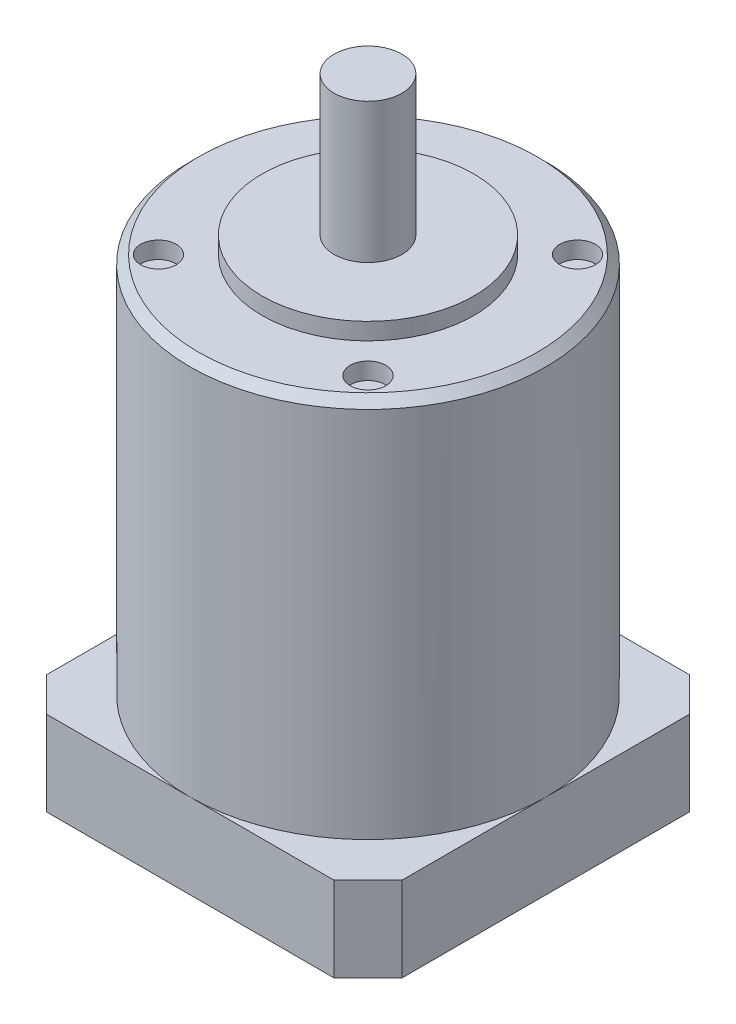
ISO-10303-21;
HEADER;
FILE_DESCRIPTION(('STEP AP214'),'2;1');
FILE_NAME('part.step','',(''),(''),'','','');
FILE_SCHEMA(('AUTOMOTIVE_DESIGN { 1 0 10303 214 1 1 1 1 }'));
ENDSEC;
DATA;
#1=APPLICATION_CONTEXT('core data for automotive mechanical design processes');
#2=APPLICATION_PROTOCOL_DEFINITION('international standard','automotive_design',2000,#1);
#3=PRODUCT_CONTEXT('',#1,'mechanical');
#4=PRODUCT('Part','Part','',(#3));
#5=PRODUCT_RELATED_PRODUCT_CATEGORY('part','',(#4));
#6=PRODUCT_DEFINITION_FORMATION('','',#4);
#7=PRODUCT_DEFINITION_CONTEXT('part definition',#1,'design');
#8=PRODUCT_DEFINITION('design','',#6,#7);
#9=PRODUCT_DEFINITION_SHAPE('','',#8);
#10=(LENGTH_UNIT() NAMED_UNIT(*) SI_UNIT(.MILLI.,.METRE.));
#11=(NAMED_UNIT(*) PLANE_ANGLE_UNIT() SI_UNIT($,.RADIAN.));
#12=(NAMED_UNIT(*) SI_UNIT($,.STERADIAN.) SOLID_ANGLE_UNIT());
#13=UNCERTAINTY_MEASURE_WITH_UNIT(LENGTH_MEASURE(1.E-05),#10,'distance_accuracy_value','');
#14=(GEOMETRIC_REPRESENTATION_CONTEXT(3) GLOBAL_UNCERTAINTY_ASSIGNED_CONTEXT((#13)) GLOBAL_UNIT_ASSIGNED_CONTEXT((#10,
#11,#12)) REPRESENTATION_CONTEXT('',''));
#15=CARTESIAN_POINT('',(0.,0.,0.));
#16=DIRECTION('',(0.,0.,1.));
#17=DIRECTION('',(1.,0.,0.));
#18=AXIS2_PLACEMENT_3D('',#15,#16,#17);
#19=CARTESIAN_POINT('',(0.,10.,0.));
#20=DIRECTION('',(0.,-1.,0.));
#21=DIRECTION('',(0.,0.,-1.));
#22=AXIS2_PLACEMENT_3D('',#19,#20,#21);
#23=PLANE('',#22);
#24=DIRECTION('',(1.,0.,0.));
#25=VECTOR('',#24,1.);
#26=CARTESIAN_POINT('',(-21.,10.,21.));
#27=LINE('',#26,#25);
#28=CARTESIAN_POINT('',(0.,10.,21.));
#29=VERTEX_POINT('',#28);
#30=CARTESIAN_POINT('',(17.,10.,21.));
#31=VERTEX_POINT('',#30);
#32=EDGE_CURVE('E120',#29,#31,#27,.T.);
#33=ORIENTED_EDGE('',*,*,#32,.T.);
#34=DIRECTION('',(-0.70710678118655,0.,0.707106781186545));
#35=VECTOR('',#34,1.);
#36=CARTESIAN_POINT('',(21.,10.,17.));
#37=LINE('',#36,#35);
#38=CARTESIAN_POINT('',(21.,10.,17.));
#39=VERTEX_POINT('',#38);
#40=EDGE_CURVE('E193',#31,#39,#37,.F.);
#41=ORIENTED_EDGE('',*,*,#40,.T.);
#42=DIRECTION('',(0.,0.,-1.));
#43=VECTOR('',#42,1.);
#44=CARTESIAN_POINT('',(21.,10.,21.));
#45=LINE('',#44,#43);
#46=CARTESIAN_POINT('',(21.,10.,0.));
#47=VERTEX_POINT('',#46);
#48=EDGE_CURVE('E130',#39,#47,#45,.T.);
#49=ORIENTED_EDGE('',*,*,#48,.T.);
#50=CARTESIAN_POINT('',(0.,10.,0.));
#51=DIRECTION('',(0.,1.,0.));
#52=DIRECTION('',(0.,0.,1.));
#53=AXIS2_PLACEMENT_3D('',#50,#51,#52);
#54=CIRCLE('',#53,21.);
#55=EDGE_CURVE('E128',#29,#47,#54,.T.);
#56=ORIENTED_EDGE('',*,*,#55,.F.);
#57=EDGE_LOOP('',(#33,#41,#49,#56));
#58=FACE_BOUND('',#57,.T.);
#59=ADVANCED_FACE('F35',(#58),#23,.F.);
#60=CARTESIAN_POINT('',(21.,10.,-17.));
#61=VERTEX_POINT('',#60);
#62=EDGE_CURVE('E147',#47,#61,#45,.T.);
#63=ORIENTED_EDGE('',*,*,#62,.T.);
#64=DIRECTION('',(0.707106781186546,0.,0.707106781186549));
#65=VECTOR('',#64,1.);
#66=CARTESIAN_POINT('',(17.,10.,-21.));
#67=LINE('',#66,#65);
#68=CARTESIAN_POINT('',(17.,10.,-21.));
#69=VERTEX_POINT('',#68);
#70=EDGE_CURVE('E180',#61,#69,#67,.F.);
#71=ORIENTED_EDGE('',*,*,#70,.T.);
#72=DIRECTION('',(-1.,0.,0.));
#73=VECTOR('',#72,1.);
#74=CARTESIAN_POINT('',(-21.,10.,-21.));
#75=LINE('',#74,#73);
#76=CARTESIAN_POINT('',(0.,10.,-21.));
#77=VERTEX_POINT('',#76);
#78=EDGE_CURVE('E148',#69,#77,#75,.T.);
#79=ORIENTED_EDGE('',*,*,#78,.T.);
#80=EDGE_CURVE('E137',#47,#77,#54,.T.);
#81=ORIENTED_EDGE('',*,*,#80,.F.);
#82=EDGE_LOOP('',(#63,#71,#79,#81));
#83=FACE_BOUND('',#82,.T.);
#84=ADVANCED_FACE('F221',(#83),#23,.F.);
#85=CARTESIAN_POINT('',(-17.,10.,-21.));
#86=VERTEX_POINT('',#85);
#87=EDGE_CURVE('E146',#77,#86,#75,.T.);
#88=ORIENTED_EDGE('',*,*,#87,.T.);
#89=DIRECTION('',(0.707106781186549,0.,-0.707106781186546));
#90=VECTOR('',#89,1.);
#91=CARTESIAN_POINT('',(-21.,10.,-17.));
#92=LINE('',#91,#90);
#93=CARTESIAN_POINT('',(-21.,10.,-17.));
#94=VERTEX_POINT('',#93);
#95=EDGE_CURVE('E187',#86,#94,#92,.F.);
#96=ORIENTED_EDGE('',*,*,#95,.T.);
#97=DIRECTION('',(0.,0.,1.));
#98=VECTOR('',#97,1.);
#99=CARTESIAN_POINT('',(-21.,10.,21.));
#100=LINE('',#99,#98);
#101=CARTESIAN_POINT('',(-21.,10.,0.));
#102=VERTEX_POINT('',#101);
#103=EDGE_CURVE('E126',#94,#102,#100,.T.);
#104=ORIENTED_EDGE('',*,*,#103,.T.);
#105=EDGE_CURVE('E141',#77,#102,#54,.T.);
#106=ORIENTED_EDGE('',*,*,#105,.F.);
#107=EDGE_LOOP('',(#88,#96,#104,#106));
#108=FACE_BOUND('',#107,.T.);
#109=ADVANCED_FACE('F226',(#108),#23,.F.);
#110=CARTESIAN_POINT('',(21.,10.,21.));
#111=DIRECTION('',(-1.,0.,0.));
#112=DIRECTION('',(0.,0.,1.));
#113=AXIS2_PLACEMENT_3D('',#110,#111,#112);
#114=PLANE('',#113);
#115=DIRECTION('',(0.,0.,-1.));
#116=VECTOR('',#115,1.);
#117=CARTESIAN_POINT('',(21.,0.,21.));
#118=LINE('',#117,#116);
#119=CARTESIAN_POINT('',(21.,0.,17.));
#120=VERTEX_POINT('',#119);
#121=CARTESIAN_POINT('',(21.,0.,-17.));
#122=VERTEX_POINT('',#121);
#123=EDGE_CURVE('E134',#120,#122,#118,.T.);
#124=ORIENTED_EDGE('',*,*,#123,.T.);
#125=DIRECTION('',(0.,1.,0.));
#126=VECTOR('',#125,1.);
#127=CARTESIAN_POINT('',(21.,10.,-17.));
#128=LINE('',#127,#126);
#129=EDGE_CURVE('E178',#122,#61,#128,.T.);
#130=ORIENTED_EDGE('',*,*,#129,.T.);
#131=ORIENTED_EDGE('',*,*,#62,.F.);
#132=ORIENTED_EDGE('',*,*,#48,.F.);
#133=DIRECTION('',(0.,-1.,0.));
#134=VECTOR('',#133,1.);
#135=CARTESIAN_POINT('',(21.,10.,17.));
#136=LINE('',#135,#134);
#137=EDGE_CURVE('E175',#39,#120,#136,.T.);
#138=ORIENTED_EDGE('',*,*,#137,.T.);
#139=EDGE_LOOP('',(#124,#130,#131,#132,#138));
#140=FACE_BOUND('',#139,.T.);
#141=ADVANCED_FACE('F240',(#140),#114,.F.);
#142=CARTESIAN_POINT('',(-21.,10.,-21.));
#143=DIRECTION('',(0.,0.,1.));
#144=DIRECTION('',(1.,0.,0.));
#145=AXIS2_PLACEMENT_3D('',#142,#143,#144);
#146=PLANE('',#145);
#147=ORIENTED_EDGE('',*,*,#78,.F.);
#148=DIRECTION('',(0.,-1.,0.));
#149=VECTOR('',#148,1.);
#150=CARTESIAN_POINT('',(17.,10.,-21.));
#151=LINE('',#150,#149);
#152=CARTESIAN_POINT('',(17.,0.,-21.));
#153=VERTEX_POINT('',#152);
#154=EDGE_CURVE('E164',#69,#153,#151,.T.);
#155=ORIENTED_EDGE('',*,*,#154,.T.);
#156=DIRECTION('',(-1.,0.,0.));
#157=VECTOR('',#156,1.);
#158=CARTESIAN_POINT('',(-21.,0.,-21.));
#159=LINE('',#158,#157);
#160=CARTESIAN_POINT('',(-17.,0.,-21.));
#161=VERTEX_POINT('',#160);
#162=EDGE_CURVE('E154',#153,#161,#159,.T.);
#163=ORIENTED_EDGE('',*,*,#162,.T.);
#164=DIRECTION('',(0.,1.,0.));
#165=VECTOR('',#164,1.);
#166=CARTESIAN_POINT('',(-17.,10.,-21.));
#167=LINE('',#166,#165);
#168=EDGE_CURVE('E162',#161,#86,#167,.T.);
#169=ORIENTED_EDGE('',*,*,#168,.T.);
#170=ORIENTED_EDGE('',*,*,#87,.F.);
#171=EDGE_LOOP('',(#147,#155,#163,#169,#170));
#172=FACE_BOUND('',#171,.T.);
#173=ADVANCED_FACE('F245',(#172),#146,.F.);
#174=CARTESIAN_POINT('',(-21.,10.,21.));
#175=DIRECTION('',(1.,0.,0.));
#176=DIRECTION('',(0.,0.,-1.));
#177=AXIS2_PLACEMENT_3D('',#174,#175,#176);
#178=PLANE('',#177);
#179=ORIENTED_EDGE('',*,*,#103,.F.);
#180=DIRECTION('',(0.,-1.,0.));
#181=VECTOR('',#180,1.);
#182=CARTESIAN_POINT('',(-21.,10.,-17.));
#183=LINE('',#182,#181);
#184=CARTESIAN_POINT('',(-21.,0.,-17.));
#185=VERTEX_POINT('',#184);
#186=EDGE_CURVE('E184',#94,#185,#183,.T.);
#187=ORIENTED_EDGE('',*,*,#186,.T.);
#188=DIRECTION('',(0.,0.,1.));
#189=VECTOR('',#188,1.);
#190=CARTESIAN_POINT('',(-21.,0.,21.));
#191=LINE('',#190,#189);
#192=CARTESIAN_POINT('',(-21.,0.,17.));
#193=VERTEX_POINT('',#192);
#194=EDGE_CURVE('E157',#185,#193,#191,.T.);
#195=ORIENTED_EDGE('',*,*,#194,.T.);
#196=DIRECTION('',(0.,1.,0.));
#197=VECTOR('',#196,1.);
#198=CARTESIAN_POINT('',(-21.,10.,17.));
#199=LINE('',#198,#197);
#200=CARTESIAN_POINT('',(-21.,10.,17.));
#201=VERTEX_POINT('',#200);
#202=EDGE_CURVE('E182',#193,#201,#199,.T.);
#203=ORIENTED_EDGE('',*,*,#202,.T.);
#204=EDGE_CURVE('E150',#102,#201,#100,.T.);
#205=ORIENTED_EDGE('',*,*,#204,.F.);
#206=EDGE_LOOP('',(#179,#187,#195,#203,#205));
#207=FACE_BOUND('',#206,.T.);
#208=ADVANCED_FACE('F237',(#207),#178,.F.);
#209=CARTESIAN_POINT('',(-21.,10.,21.));
#210=DIRECTION('',(0.,0.,-1.));
#211=DIRECTION('',(-1.,0.,0.));
#212=AXIS2_PLACEMENT_3D('',#209,#210,#211);
#213=PLANE('',#212);
#214=CARTESIAN_POINT('',(-17.,10.,21.));
#215=VERTEX_POINT('',#214);
#216=EDGE_CURVE('E113',#215,#29,#27,.T.);
#217=ORIENTED_EDGE('',*,*,#216,.F.);
#218=DIRECTION('',(0.,-1.,0.));
#219=VECTOR('',#218,1.);
#220=CARTESIAN_POINT('',(-17.,10.,21.));
#221=LINE('',#220,#219);
#222=CARTESIAN_POINT('',(-17.,0.,21.));
#223=VERTEX_POINT('',#222);
#224=EDGE_CURVE('E190',#215,#223,#221,.T.);
#225=ORIENTED_EDGE('',*,*,#224,.T.);
#226=DIRECTION('',(1.,0.,0.));
#227=VECTOR('',#226,1.);
#228=CARTESIAN_POINT('',(-21.,0.,21.));
#229=LINE('',#228,#227);
#230=CARTESIAN_POINT('',(17.,0.,21.));
#231=VERTEX_POINT('',#230);
#232=EDGE_CURVE('E160',#223,#231,#229,.T.);
#233=ORIENTED_EDGE('',*,*,#232,.T.);
#234=DIRECTION('',(0.,1.,0.));
#235=VECTOR('',#234,1.);
#236=CARTESIAN_POINT('',(17.,10.,21.));
#237=LINE('',#236,#235);
#238=EDGE_CURVE('E58',#231,#31,#237,.T.);
#239=ORIENTED_EDGE('',*,*,#238,.T.);
#240=ORIENTED_EDGE('',*,*,#32,.F.);
#241=EDGE_LOOP('',(#217,#225,#233,#239,#240));
#242=FACE_BOUND('',#241,.T.);
#243=ADVANCED_FACE('F123',(#242),#213,.F.);
#244=ORIENTED_EDGE('',*,*,#204,.T.);
#245=DIRECTION('',(-0.707106781186545,0.,-0.70710678118655));
#246=VECTOR('',#245,1.);
#247=CARTESIAN_POINT('',(-17.,10.,21.));
#248=LINE('',#247,#246);
#249=EDGE_CURVE('E50',#201,#215,#248,.F.);
#250=ORIENTED_EDGE('',*,*,#249,.T.);
#251=ORIENTED_EDGE('',*,*,#216,.T.);
#252=EDGE_CURVE('E116',#102,#29,#54,.T.);
#253=ORIENTED_EDGE('',*,*,#252,.F.);
#254=EDGE_LOOP('',(#244,#250,#251,#253));
#255=FACE_BOUND('',#254,.T.);
#256=ADVANCED_FACE('F114',(#255),#23,.F.);
#257=CARTESIAN_POINT('',(0.,0.,0.));
#258=DIRECTION('',(0.,-1.,0.));
#259=DIRECTION('',(0.,0.,-1.));
#260=AXIS2_PLACEMENT_3D('',#257,#258,#259);
#261=PLANE('',#260);
#262=CARTESIAN_POINT('',(15.5,0.,15.4999999999999));
#263=DIRECTION('',(0.,-1.,0.));
#264=DIRECTION('',(-1.,0.,0.));
#265=AXIS2_PLACEMENT_3D('',#262,#263,#264);
#266=CIRCLE('',#265,2.1);
#267=CARTESIAN_POINT('',(13.4000000000001,0.,15.5));
#268=VERTEX_POINT('',#267);
#269=EDGE_CURVE('E673',#268,#268,#266,.T.);
#270=ORIENTED_EDGE('',*,*,#269,.F.);
#271=EDGE_LOOP('',(#270));
#272=FACE_BOUND('',#271,.T.);
#273=CARTESIAN_POINT('',(15.5,0.,-15.5));
#274=DIRECTION('',(0.,-1.,0.));
#275=DIRECTION('',(0.,0.,1.));
#276=AXIS2_PLACEMENT_3D('',#273,#274,#275);
#277=CIRCLE('',#276,2.1);
#278=CARTESIAN_POINT('',(15.5,0.,-13.4));
#279=VERTEX_POINT('',#278);
#280=EDGE_CURVE('E667',#279,#279,#277,.T.);
#281=ORIENTED_EDGE('',*,*,#280,.F.);
#282=EDGE_LOOP('',(#281));
#283=FACE_BOUND('',#282,.T.);
#284=CARTESIAN_POINT('',(-15.5000000000002,0.,-15.4999999999998));
#285=DIRECTION('',(0.,-1.,0.));
#286=DIRECTION('',(1.,0.,0.));
#287=AXIS2_PLACEMENT_3D('',#284,#285,#286);
#288=CIRCLE('',#287,2.1);
#289=CARTESIAN_POINT('',(-13.4000000000002,0.,-15.4999999999999));
#290=VERTEX_POINT('',#289);
#291=EDGE_CURVE('E661',#290,#290,#288,.T.);
#292=ORIENTED_EDGE('',*,*,#291,.F.);
#293=EDGE_LOOP('',(#292));
#294=FACE_BOUND('',#293,.T.);
#295=CARTESIAN_POINT('',(-15.5,0.,15.5));
#296=DIRECTION('',(0.,-1.,0.));
#297=DIRECTION('',(0.,0.,-1.));
#298=AXIS2_PLACEMENT_3D('',#295,#296,#297);
#299=CIRCLE('',#298,2.1);
#300=CARTESIAN_POINT('',(-15.5,0.,13.4));
#301=VERTEX_POINT('',#300);
#302=EDGE_CURVE('E655',#301,#301,#299,.T.);
#303=ORIENTED_EDGE('',*,*,#302,.F.);
#304=EDGE_LOOP('',(#303));
#305=FACE_BOUND('',#304,.T.);
#306=CARTESIAN_POINT('',(0.,0.,0.));
#307=DIRECTION('',(0.,-1.,0.));
#308=DIRECTION('',(0.,0.,-1.));
#309=AXIS2_PLACEMENT_3D('',#306,#307,#308);
#310=CIRCLE('',#309,11.);
#311=CARTESIAN_POINT('',(0.,0.,-11.));
#312=VERTEX_POINT('',#311);
#313=EDGE_CURVE('E197',#312,#312,#310,.T.);
#314=ORIENTED_EDGE('',*,*,#313,.F.);
#315=EDGE_LOOP('',(#314));
#316=FACE_BOUND('',#315,.T.);
#317=ORIENTED_EDGE('',*,*,#162,.F.);
#318=DIRECTION('',(-0.707106781186546,0.,-0.707106781186549));
#319=VECTOR('',#318,1.);
#320=CARTESIAN_POINT('',(19.,0.,-19.));
#321=LINE('',#320,#319);
#322=EDGE_CURVE('E173',#153,#122,#321,.F.);
#323=ORIENTED_EDGE('',*,*,#322,.T.);
#324=ORIENTED_EDGE('',*,*,#123,.F.);
#325=DIRECTION('',(0.70710678118655,0.,-0.707106781186545));
#326=VECTOR('',#325,1.);
#327=CARTESIAN_POINT('',(18.9999999999999,0.,19.0000000000001));
#328=LINE('',#327,#326);
#329=EDGE_CURVE('E167',#120,#231,#328,.F.);
#330=ORIENTED_EDGE('',*,*,#329,.T.);
#331=ORIENTED_EDGE('',*,*,#232,.F.);
#332=DIRECTION('',(0.707106781186545,0.,0.70710678118655));
#333=VECTOR('',#332,1.);
#334=CARTESIAN_POINT('',(-19.0000000000001,0.,18.9999999999999));
#335=LINE('',#334,#333);
#336=EDGE_CURVE('E169',#223,#193,#335,.F.);
#337=ORIENTED_EDGE('',*,*,#336,.T.);
#338=ORIENTED_EDGE('',*,*,#194,.F.);
#339=DIRECTION('',(-0.707106781186549,0.,0.707106781186546));
#340=VECTOR('',#339,1.);
#341=CARTESIAN_POINT('',(-19.,0.,-19.));
#342=LINE('',#341,#340);
#343=EDGE_CURVE('E171',#185,#161,#342,.F.);
#344=ORIENTED_EDGE('',*,*,#343,.T.);
#345=EDGE_LOOP('',(#317,#323,#324,#330,#331,#337,#338,#344));
#346=FACE_BOUND('',#345,.T.);
#347=ADVANCED_FACE('F231',(#272,#283,#294,#305,#316,#346),#261,.T.);
#348=CARTESIAN_POINT('',(0.,55.,0.));
#349=DIRECTION('',(0.,-1.,0.));
#350=DIRECTION('',(0.,0.,-1.));
#351=AXIS2_PLACEMENT_3D('',#348,#349,#350);
#352=CYLINDRICAL_SURFACE('',#351,21.);
#353=CARTESIAN_POINT('',(0.,54.,0.));
#354=DIRECTION('',(0.,1.,0.));
#355=DIRECTION('',(0.,0.,1.));
#356=AXIS2_PLACEMENT_3D('',#353,#354,#355);
#357=CIRCLE('',#356,21.);
#358=CARTESIAN_POINT('',(0.,54.,21.));
#359=VERTEX_POINT('',#358);
#360=EDGE_CURVE('E11',#359,#359,#357,.F.);
#361=ORIENTED_EDGE('',*,*,#360,.T.);
#362=EDGE_LOOP('',(#361));
#363=FACE_BOUND('',#362,.T.);
#364=ORIENTED_EDGE('',*,*,#55,.T.);
#365=ORIENTED_EDGE('',*,*,#80,.T.);
#366=ORIENTED_EDGE('',*,*,#105,.T.);
#367=ORIENTED_EDGE('',*,*,#252,.T.);
#368=EDGE_LOOP('',(#364,#365,#366,#367));
#369=FACE_BOUND('',#368,.T.);
#370=ADVANCED_FACE('F139',(#363,#369),#352,.T.);
#371=CARTESIAN_POINT('',(0.,55.,0.));
#372=DIRECTION('',(0.,1.,0.));
#373=DIRECTION('',(0.,0.,1.));
#374=AXIS2_PLACEMENT_3D('',#371,#372,#373);
#375=PLANE('',#374);
#376=CARTESIAN_POINT('',(12.3743686707646,55.,-12.3743686707645));
#377=DIRECTION('',(0.,1.,0.));
#378=DIRECTION('',(-1.,0.,0.));
#379=AXIS2_PLACEMENT_3D('',#376,#377,#378);
#380=CIRCLE('',#379,2.1);
#381=CARTESIAN_POINT('',(10.2743686707646,55.,-12.3743686707645));
#382=VERTEX_POINT('',#381);
#383=EDGE_CURVE('E650',#382,#382,#380,.T.);
#384=ORIENTED_EDGE('',*,*,#383,.F.);
#385=EDGE_LOOP('',(#384));
#386=FACE_BOUND('',#385,.T.);
#387=CARTESIAN_POINT('',(12.3743686707646,55.,12.3743686707646));
#388=DIRECTION('',(0.,1.,0.));
#389=DIRECTION('',(0.,0.,-1.));
#390=AXIS2_PLACEMENT_3D('',#387,#388,#389);
#391=CIRCLE('',#390,2.1);
#392=CARTESIAN_POINT('',(12.3743686707646,55.,10.2743686707646));
#393=VERTEX_POINT('',#392);
#394=EDGE_CURVE('E644',#393,#393,#391,.T.);
#395=ORIENTED_EDGE('',*,*,#394,.F.);
#396=EDGE_LOOP('',(#395));
#397=FACE_BOUND('',#396,.T.);
#398=CARTESIAN_POINT('',(-12.3743686707647,55.,12.3743686707644));
#399=DIRECTION('',(0.,1.,0.));
#400=DIRECTION('',(1.,0.,0.));
#401=AXIS2_PLACEMENT_3D('',#398,#399,#400);
#402=CIRCLE('',#401,2.1);
#403=CARTESIAN_POINT('',(-10.2743686707647,55.,12.3743686707645));
#404=VERTEX_POINT('',#403);
#405=EDGE_CURVE('E622',#404,#404,#402,.T.);
#406=ORIENTED_EDGE('',*,*,#405,.F.);
#407=EDGE_LOOP('',(#406));
#408=FACE_BOUND('',#407,.T.);
#409=CARTESIAN_POINT('',(-12.3743686707646,55.,-12.3743686707646));
#410=DIRECTION('',(0.,1.,0.));
#411=DIRECTION('',(0.,0.,1.));
#412=AXIS2_PLACEMENT_3D('',#409,#410,#411);
#413=CIRCLE('',#412,2.1);
#414=CARTESIAN_POINT('',(-12.3743686707646,55.,-10.2743686707646));
#415=VERTEX_POINT('',#414);
#416=EDGE_CURVE('E614',#415,#415,#413,.T.);
#417=ORIENTED_EDGE('',*,*,#416,.F.);
#418=EDGE_LOOP('',(#417));
#419=FACE_BOUND('',#418,.T.);
#420=CARTESIAN_POINT('',(0.,55.,0.));
#421=DIRECTION('',(0.,1.,0.));
#422=DIRECTION('',(0.,0.,1.));
#423=AXIS2_PLACEMENT_3D('',#420,#421,#422);
#424=CIRCLE('',#423,20.);
#425=CARTESIAN_POINT('',(0.,55.,20.));
#426=VERTEX_POINT('',#425);
#427=EDGE_CURVE('E43',#426,#426,#424,.T.);
#428=ORIENTED_EDGE('',*,*,#427,.T.);
#429=EDGE_LOOP('',(#428));
#430=FACE_BOUND('',#429,.T.);
#431=CARTESIAN_POINT('',(0.,55.,0.));
#432=DIRECTION('',(0.,1.,0.));
#433=DIRECTION('',(0.,0.,1.));
#434=AXIS2_PLACEMENT_3D('',#431,#432,#433);
#435=CIRCLE('',#434,12.5);
#436=CARTESIAN_POINT('',(0.,55.,12.5));
#437=VERTEX_POINT('',#436);
#438=EDGE_CURVE('E613',#437,#437,#435,.T.);
#439=ORIENTED_EDGE('',*,*,#438,.F.);
#440=EDGE_LOOP('',(#439));
#441=FACE_BOUND('',#440,.T.);
#442=ADVANCED_FACE('F202',(#386,#397,#408,#419,#430,#441),#375,.T.);
#443=CARTESIAN_POINT('',(17.,10.,-21.));
#444=DIRECTION('',(-0.707106781186549,0.,0.707106781186546));
#445=DIRECTION('',(0.,-1.,0.));
#446=AXIS2_PLACEMENT_3D('',#443,#444,#445);
#447=PLANE('',#446);
#448=ORIENTED_EDGE('',*,*,#70,.F.);
#449=ORIENTED_EDGE('',*,*,#129,.F.);
#450=ORIENTED_EDGE('',*,*,#322,.F.);
#451=ORIENTED_EDGE('',*,*,#154,.F.);
#452=EDGE_LOOP('',(#448,#449,#450,#451));
#453=FACE_BOUND('',#452,.T.);
#454=ADVANCED_FACE('F276',(#453),#447,.F.);
#455=CARTESIAN_POINT('',(-21.,10.,-17.));
#456=DIRECTION('',(0.707106781186546,0.,0.707106781186549));
#457=DIRECTION('',(0.,-1.,0.));
#458=AXIS2_PLACEMENT_3D('',#455,#456,#457);
#459=PLANE('',#458);
#460=ORIENTED_EDGE('',*,*,#95,.F.);
#461=ORIENTED_EDGE('',*,*,#168,.F.);
#462=ORIENTED_EDGE('',*,*,#343,.F.);
#463=ORIENTED_EDGE('',*,*,#186,.F.);
#464=EDGE_LOOP('',(#460,#461,#462,#463));
#465=FACE_BOUND('',#464,.T.);
#466=ADVANCED_FACE('F257',(#465),#459,.F.);
#467=CARTESIAN_POINT('',(-17.,10.,21.));
#468=DIRECTION('',(0.70710678118655,0.,-0.707106781186545));
#469=DIRECTION('',(0.,-1.,0.));
#470=AXIS2_PLACEMENT_3D('',#467,#468,#469);
#471=PLANE('',#470);
#472=ORIENTED_EDGE('',*,*,#249,.F.);
#473=ORIENTED_EDGE('',*,*,#202,.F.);
#474=ORIENTED_EDGE('',*,*,#336,.F.);
#475=ORIENTED_EDGE('',*,*,#224,.F.);
#476=EDGE_LOOP('',(#472,#473,#474,#475));
#477=FACE_BOUND('',#476,.T.);
#478=ADVANCED_FACE('F265',(#477),#471,.F.);
#479=CARTESIAN_POINT('',(21.,10.,17.));
#480=DIRECTION('',(-0.707106781186545,0.,-0.70710678118655));
#481=DIRECTION('',(0.,-1.,0.));
#482=AXIS2_PLACEMENT_3D('',#479,#480,#481);
#483=PLANE('',#482);
#484=ORIENTED_EDGE('',*,*,#40,.F.);
#485=ORIENTED_EDGE('',*,*,#238,.F.);
#486=ORIENTED_EDGE('',*,*,#329,.F.);
#487=ORIENTED_EDGE('',*,*,#137,.F.);
#488=EDGE_LOOP('',(#484,#485,#486,#487));
#489=FACE_BOUND('',#488,.T.);
#490=ADVANCED_FACE('F267',(#489),#483,.F.);
#491=CARTESIAN_POINT('',(0.,25.,0.));
#492=DIRECTION('',(0.,-1.,0.));
#493=DIRECTION('',(0.,0.,-1.));
#494=AXIS2_PLACEMENT_3D('',#491,#492,#493);
#495=CYLINDRICAL_SURFACE('',#494,11.);
#496=CARTESIAN_POINT('',(0.,25.,0.));
#497=DIRECTION('',(0.,-1.,0.));
#498=DIRECTION('',(0.,0.,-1.));
#499=AXIS2_PLACEMENT_3D('',#496,#497,#498);
#500=CIRCLE('',#499,11.);
#501=CARTESIAN_POINT('',(0.,25.,-11.));
#502=VERTEX_POINT('',#501);
#503=EDGE_CURVE('E627',#502,#502,#500,.T.);
#504=ORIENTED_EDGE('',*,*,#503,.F.);
#505=EDGE_LOOP('',(#504));
#506=FACE_BOUND('',#505,.T.);
#507=ORIENTED_EDGE('',*,*,#313,.T.);
#508=EDGE_LOOP('',(#507));
#509=FACE_BOUND('',#508,.T.);
#510=ADVANCED_FACE('F290',(#506,#509),#495,.F.);
#511=CARTESIAN_POINT('',(0.,25.,0.));
#512=DIRECTION('',(0.,-1.,0.));
#513=DIRECTION('',(0.,0.,-1.));
#514=AXIS2_PLACEMENT_3D('',#511,#512,#513);
#515=PLANE('',#514);
#516=ORIENTED_EDGE('',*,*,#503,.T.);
#517=EDGE_LOOP('',(#516));
#518=FACE_BOUND('',#517,.T.);
#519=ADVANCED_FACE('F294',(#518),#515,.T.);
#520=CARTESIAN_POINT('',(0.,57.,0.));
#521=DIRECTION('',(0.,-1.,0.));
#522=DIRECTION('',(0.,0.,-1.));
#523=AXIS2_PLACEMENT_3D('',#520,#521,#522);
#524=CYLINDRICAL_SURFACE('',#523,12.5);
#525=CARTESIAN_POINT('',(0.,57.,0.));
#526=DIRECTION('',(0.,1.,0.));
#527=DIRECTION('',(0.,0.,1.));
#528=AXIS2_PLACEMENT_3D('',#525,#526,#527);
#529=CIRCLE('',#528,12.5);
#530=CARTESIAN_POINT('',(0.,57.,12.5));
#531=VERTEX_POINT('',#530);
#532=EDGE_CURVE('E198',#531,#531,#529,.T.);
#533=ORIENTED_EDGE('',*,*,#532,.F.);
#534=EDGE_LOOP('',(#533));
#535=FACE_BOUND('',#534,.T.);
#536=ORIENTED_EDGE('',*,*,#438,.T.);
#537=EDGE_LOOP('',(#536));
#538=FACE_BOUND('',#537,.T.);
#539=ADVANCED_FACE('F300',(#535,#538),#524,.T.);
#540=CARTESIAN_POINT('',(0.,57.,0.));
#541=DIRECTION('',(0.,1.,0.));
#542=DIRECTION('',(0.,0.,1.));
#543=AXIS2_PLACEMENT_3D('',#540,#541,#542);
#544=PLANE('',#543);
#545=CARTESIAN_POINT('',(0.,57.,0.));
#546=DIRECTION('',(0.,1.,0.));
#547=DIRECTION('',(0.,0.,1.));
#548=AXIS2_PLACEMENT_3D('',#545,#546,#547);
#549=CIRCLE('',#548,4.);
#550=CARTESIAN_POINT('',(0.,57.,4.));
#551=VERTEX_POINT('',#550);
#552=EDGE_CURVE('E195',#551,#551,#549,.T.);
#553=ORIENTED_EDGE('',*,*,#552,.F.);
#554=EDGE_LOOP('',(#553));
#555=FACE_BOUND('',#554,.T.);
#556=ORIENTED_EDGE('',*,*,#532,.T.);
#557=EDGE_LOOP('',(#556));
#558=FACE_BOUND('',#557,.T.);
#559=ADVANCED_FACE('F308',(#555,#558),#544,.T.);
#560=CARTESIAN_POINT('',(0.,73.5,0.));
#561=DIRECTION('',(0.,1.,0.));
#562=DIRECTION('',(0.,0.,1.));
#563=AXIS2_PLACEMENT_3D('',#560,#561,#562);
#564=PLANE('',#563);
#565=CARTESIAN_POINT('',(0.,73.5,0.));
#566=DIRECTION('',(0.,1.,0.));
#567=DIRECTION('',(0.,0.,1.));
#568=AXIS2_PLACEMENT_3D('',#565,#566,#567);
#569=CIRCLE('',#568,4.);
#570=CARTESIAN_POINT('',(0.,73.5,4.));
#571=VERTEX_POINT('',#570);
#572=EDGE_CURVE('E135',#571,#571,#569,.T.);
#573=ORIENTED_EDGE('',*,*,#572,.T.);
#574=EDGE_LOOP('',(#573));
#575=FACE_BOUND('',#574,.T.);
#576=ADVANCED_FACE('F216',(#575),#564,.T.);
#577=CARTESIAN_POINT('',(0.,73.5,0.));
#578=DIRECTION('',(0.,-1.,0.));
#579=DIRECTION('',(0.,0.,-1.));
#580=AXIS2_PLACEMENT_3D('',#577,#578,#579);
#581=CYLINDRICAL_SURFACE('',#580,4.);
#582=ORIENTED_EDGE('',*,*,#552,.T.);
#583=EDGE_LOOP('',(#582));
#584=FACE_BOUND('',#583,.T.);
#585=ORIENTED_EDGE('',*,*,#572,.F.);
#586=EDGE_LOOP('',(#585));
#587=FACE_BOUND('',#586,.T.);
#588=ADVANCED_FACE('F207',(#584,#587),#581,.T.);
#589=CARTESIAN_POINT('',(0.,55.,0.));
#590=DIRECTION('',(0.,-1.,0.));
#591=DIRECTION('',(0.,0.,-1.));
#592=AXIS2_PLACEMENT_3D('',#589,#590,#591);
#593=CONICAL_SURFACE('',#592,20.,0.785398163397443);
#594=ORIENTED_EDGE('',*,*,#360,.F.);
#595=EDGE_LOOP('',(#594));
#596=FACE_BOUND('',#595,.T.);
#597=ORIENTED_EDGE('',*,*,#427,.F.);
#598=EDGE_LOOP('',(#597));
#599=FACE_BOUND('',#598,.T.);
#600=ADVANCED_FACE('F37',(#596,#599),#593,.T.);
#601=CARTESIAN_POINT('',(-12.3743686707646,53.,-12.3743686707646));
#602=DIRECTION('',(0.,1.,0.));
#603=DIRECTION('',(0.,0.,1.));
#604=AXIS2_PLACEMENT_3D('',#601,#602,#603);
#605=CYLINDRICAL_SURFACE('',#604,2.1);
#606=CARTESIAN_POINT('',(-12.3743686707646,53.,-12.3743686707646));
#607=DIRECTION('',(0.,1.,0.));
#608=DIRECTION('',(0.,0.,1.));
#609=AXIS2_PLACEMENT_3D('',#606,#607,#608);
#610=CIRCLE('',#609,2.1);
#611=CARTESIAN_POINT('',(-12.3743686707646,53.,-10.2743686707646));
#612=VERTEX_POINT('',#611);
#613=EDGE_CURVE('E612',#612,#612,#610,.T.);
#614=ORIENTED_EDGE('',*,*,#613,.F.);
#615=EDGE_LOOP('',(#614));
#616=FACE_BOUND('',#615,.T.);
#617=ORIENTED_EDGE('',*,*,#416,.T.);
#618=EDGE_LOOP('',(#617));
#619=FACE_BOUND('',#618,.T.);
#620=ADVANCED_FACE('F206',(#616,#619),#605,.F.);
#621=CARTESIAN_POINT('',(-12.3743686707646,53.,-12.3743686707646));
#622=DIRECTION('',(0.,1.,0.));
#623=DIRECTION('',(0.,0.,1.));
#624=AXIS2_PLACEMENT_3D('',#621,#622,#623);
#625=PLANE('',#624);
#626=ORIENTED_EDGE('',*,*,#613,.T.);
#627=EDGE_LOOP('',(#626));
#628=FACE_BOUND('',#627,.T.);
#629=ADVANCED_FACE('F213',(#628),#625,.T.);
#630=CARTESIAN_POINT('',(-12.3743686707647,53.,12.3743686707644));
#631=DIRECTION('',(0.,1.,0.));
#632=DIRECTION('',(0.,0.,1.));
#633=AXIS2_PLACEMENT_3D('',#630,#631,#632);
#634=CYLINDRICAL_SURFACE('',#633,2.1);
#635=CARTESIAN_POINT('',(-12.3743686707647,53.,12.3743686707644));
#636=DIRECTION('',(0.,1.,0.));
#637=DIRECTION('',(1.,0.,0.));
#638=AXIS2_PLACEMENT_3D('',#635,#636,#637);
#639=CIRCLE('',#638,2.1);
#640=CARTESIAN_POINT('',(-10.2743686707647,53.,12.3743686707645));
#641=VERTEX_POINT('',#640);
#642=EDGE_CURVE('E640',#641,#641,#639,.T.);
#643=ORIENTED_EDGE('',*,*,#642,.F.);
#644=EDGE_LOOP('',(#643));
#645=FACE_BOUND('',#644,.T.);
#646=ORIENTED_EDGE('',*,*,#405,.T.);
#647=EDGE_LOOP('',(#646));
#648=FACE_BOUND('',#647,.T.);
#649=ADVANCED_FACE('F556',(#645,#648),#634,.F.);
#650=CARTESIAN_POINT('',(-12.3743686707647,53.,12.3743686707644));
#651=DIRECTION('',(0.,1.,0.));
#652=DIRECTION('',(1.,0.,0.));
#653=AXIS2_PLACEMENT_3D('',#650,#651,#652);
#654=PLANE('',#653);
#655=ORIENTED_EDGE('',*,*,#642,.T.);
#656=EDGE_LOOP('',(#655));
#657=FACE_BOUND('',#656,.T.);
#658=ADVANCED_FACE('F549',(#657),#654,.T.);
#659=CARTESIAN_POINT('',(12.3743686707646,53.,12.3743686707646));
#660=DIRECTION('',(0.,1.,0.));
#661=DIRECTION('',(0.,0.,1.));
#662=AXIS2_PLACEMENT_3D('',#659,#660,#661);
#663=CYLINDRICAL_SURFACE('',#662,2.1);
#664=CARTESIAN_POINT('',(12.3743686707646,53.,12.3743686707646));
#665=DIRECTION('',(0.,1.,0.));
#666=DIRECTION('',(0.,0.,-1.));
#667=AXIS2_PLACEMENT_3D('',#664,#665,#666);
#668=CIRCLE('',#667,2.1);
#669=CARTESIAN_POINT('',(12.3743686707646,53.,10.2743686707646));
#670=VERTEX_POINT('',#669);
#671=EDGE_CURVE('E647',#670,#670,#668,.T.);
#672=ORIENTED_EDGE('',*,*,#671,.F.);
#673=EDGE_LOOP('',(#672));
#674=FACE_BOUND('',#673,.T.);
#675=ORIENTED_EDGE('',*,*,#394,.T.);
#676=EDGE_LOOP('',(#675));
#677=FACE_BOUND('',#676,.T.);
#678=ADVANCED_FACE('F542',(#674,#677),#663,.F.);
#679=CARTESIAN_POINT('',(12.3743686707646,53.,12.3743686707646));
#680=DIRECTION('',(0.,1.,0.));
#681=DIRECTION('',(0.,0.,-1.));
#682=AXIS2_PLACEMENT_3D('',#679,#680,#681);
#683=PLANE('',#682);
#684=ORIENTED_EDGE('',*,*,#671,.T.);
#685=EDGE_LOOP('',(#684));
#686=FACE_BOUND('',#685,.T.);
#687=ADVANCED_FACE('F533',(#686),#683,.T.);
#688=CARTESIAN_POINT('',(12.3743686707646,53.,-12.3743686707645));
#689=DIRECTION('',(0.,1.,0.));
#690=DIRECTION('',(0.,0.,1.));
#691=AXIS2_PLACEMENT_3D('',#688,#689,#690);
#692=CYLINDRICAL_SURFACE('',#691,2.1);
#693=CARTESIAN_POINT('',(12.3743686707646,53.,-12.3743686707645));
#694=DIRECTION('',(0.,1.,0.));
#695=DIRECTION('',(-1.,0.,0.));
#696=AXIS2_PLACEMENT_3D('',#693,#694,#695);
#697=CIRCLE('',#696,2.1);
#698=CARTESIAN_POINT('',(10.2743686707646,53.,-12.3743686707645));
#699=VERTEX_POINT('',#698);
#700=EDGE_CURVE('E619',#699,#699,#697,.T.);
#701=ORIENTED_EDGE('',*,*,#700,.F.);
#702=EDGE_LOOP('',(#701));
#703=FACE_BOUND('',#702,.T.);
#704=ORIENTED_EDGE('',*,*,#383,.T.);
#705=EDGE_LOOP('',(#704));
#706=FACE_BOUND('',#705,.T.);
#707=ADVANCED_FACE('F524',(#703,#706),#692,.F.);
#708=CARTESIAN_POINT('',(12.3743686707646,53.,-12.3743686707645));
#709=DIRECTION('',(0.,1.,0.));
#710=DIRECTION('',(-1.,0.,0.));
#711=AXIS2_PLACEMENT_3D('',#708,#709,#710);
#712=PLANE('',#711);
#713=ORIENTED_EDGE('',*,*,#700,.T.);
#714=EDGE_LOOP('',(#713));
#715=FACE_BOUND('',#714,.T.);
#716=ADVANCED_FACE('F515',(#715),#712,.T.);
#717=CARTESIAN_POINT('',(-15.5,8.,15.5));
#718=DIRECTION('',(0.,-1.,0.));
#719=DIRECTION('',(0.,0.,-1.));
#720=AXIS2_PLACEMENT_3D('',#717,#718,#719);
#721=CYLINDRICAL_SURFACE('',#720,2.1);
#722=CARTESIAN_POINT('',(-15.5,8.,15.5));
#723=DIRECTION('',(0.,-1.,0.));
#724=DIRECTION('',(0.,0.,-1.));
#725=AXIS2_PLACEMENT_3D('',#722,#723,#724);
#726=CIRCLE('',#725,2.1);
#727=CARTESIAN_POINT('',(-15.5,8.,13.4));
#728=VERTEX_POINT('',#727);
#729=EDGE_CURVE('E641',#728,#728,#726,.T.);
#730=ORIENTED_EDGE('',*,*,#729,.F.);
#731=EDGE_LOOP('',(#730));
#732=FACE_BOUND('',#731,.T.);
#733=ORIENTED_EDGE('',*,*,#302,.T.);
#734=EDGE_LOOP('',(#733));
#735=FACE_BOUND('',#734,.T.);
#736=ADVANCED_FACE('F510',(#732,#735),#721,.F.);
#737=CARTESIAN_POINT('',(-15.5,8.,15.5));
#738=DIRECTION('',(0.,-1.,0.));
#739=DIRECTION('',(0.,0.,-1.));
#740=AXIS2_PLACEMENT_3D('',#737,#738,#739);
#741=PLANE('',#740);
#742=ORIENTED_EDGE('',*,*,#729,.T.);
#743=EDGE_LOOP('',(#742));
#744=FACE_BOUND('',#743,.T.);
#745=ADVANCED_FACE('F431',(#744),#741,.T.);
#746=CARTESIAN_POINT('',(-15.5000000000002,8.,-15.4999999999998));
#747=DIRECTION('',(0.,-1.,0.));
#748=DIRECTION('',(0.,0.,-1.));
#749=AXIS2_PLACEMENT_3D('',#746,#747,#748);
#750=CYLINDRICAL_SURFACE('',#749,2.1);
#751=CARTESIAN_POINT('',(-15.5000000000002,8.,-15.4999999999998));
#752=DIRECTION('',(0.,-1.,0.));
#753=DIRECTION('',(1.,0.,0.));
#754=AXIS2_PLACEMENT_3D('',#751,#752,#753);
#755=CIRCLE('',#754,2.1);
#756=CARTESIAN_POINT('',(-13.4000000000002,8.,-15.4999999999999));
#757=VERTEX_POINT('',#756);
#758=EDGE_CURVE('E664',#757,#757,#755,.T.);
#759=ORIENTED_EDGE('',*,*,#758,.F.);
#760=EDGE_LOOP('',(#759));
#761=FACE_BOUND('',#760,.T.);
#762=ORIENTED_EDGE('',*,*,#291,.T.);
#763=EDGE_LOOP('',(#762));
#764=FACE_BOUND('',#763,.T.);
#765=ADVANCED_FACE('F436',(#761,#764),#750,.F.);
#766=CARTESIAN_POINT('',(-15.5000000000002,8.,-15.4999999999998));
#767=DIRECTION('',(0.,-1.,0.));
#768=DIRECTION('',(1.,0.,0.));
#769=AXIS2_PLACEMENT_3D('',#766,#767,#768);
#770=PLANE('',#769);
#771=ORIENTED_EDGE('',*,*,#758,.T.);
#772=EDGE_LOOP('',(#771));
#773=FACE_BOUND('',#772,.T.);
#774=ADVANCED_FACE('F442',(#773),#770,.T.);
#775=CARTESIAN_POINT('',(15.5,8.,-15.5));
#776=DIRECTION('',(0.,-1.,0.));
#777=DIRECTION('',(0.,0.,-1.));
#778=AXIS2_PLACEMENT_3D('',#775,#776,#777);
#779=CYLINDRICAL_SURFACE('',#778,2.1);
#780=CARTESIAN_POINT('',(15.5,8.,-15.5));
#781=DIRECTION('',(0.,-1.,0.));
#782=DIRECTION('',(0.,0.,1.));
#783=AXIS2_PLACEMENT_3D('',#780,#781,#782);
#784=CIRCLE('',#783,2.1);
#785=CARTESIAN_POINT('',(15.5,8.,-13.4));
#786=VERTEX_POINT('',#785);
#787=EDGE_CURVE('E670',#786,#786,#784,.T.);
#788=ORIENTED_EDGE('',*,*,#787,.F.);
#789=EDGE_LOOP('',(#788));
#790=FACE_BOUND('',#789,.T.);
#791=ORIENTED_EDGE('',*,*,#280,.T.);
#792=EDGE_LOOP('',(#791));
#793=FACE_BOUND('',#792,.T.);
#794=ADVANCED_FACE('F455',(#790,#793),#779,.F.);
#795=CARTESIAN_POINT('',(15.5,8.,-15.5));
#796=DIRECTION('',(0.,-1.,0.));
#797=DIRECTION('',(0.,0.,1.));
#798=AXIS2_PLACEMENT_3D('',#795,#796,#797);
#799=PLANE('',#798);
#800=ORIENTED_EDGE('',*,*,#787,.T.);
#801=EDGE_LOOP('',(#800));
#802=FACE_BOUND('',#801,.T.);
#803=ADVANCED_FACE('F467',(#802),#799,.T.);
#804=CARTESIAN_POINT('',(15.5,8.,15.4999999999999));
#805=DIRECTION('',(0.,-1.,0.));
#806=DIRECTION('',(0.,0.,-1.));
#807=AXIS2_PLACEMENT_3D('',#804,#805,#806);
#808=CYLINDRICAL_SURFACE('',#807,2.1);
#809=CARTESIAN_POINT('',(15.5,8.,15.4999999999999));
#810=DIRECTION('',(0.,-1.,0.));
#811=DIRECTION('',(-1.,0.,0.));
#812=AXIS2_PLACEMENT_3D('',#809,#810,#811);
#813=CIRCLE('',#812,2.1);
#814=CARTESIAN_POINT('',(13.4000000000001,8.,15.5));
#815=VERTEX_POINT('',#814);
#816=EDGE_CURVE('E658',#815,#815,#813,.T.);
#817=ORIENTED_EDGE('',*,*,#816,.F.);
#818=EDGE_LOOP('',(#817));
#819=FACE_BOUND('',#818,.T.);
#820=ORIENTED_EDGE('',*,*,#269,.T.);
#821=EDGE_LOOP('',(#820));
#822=FACE_BOUND('',#821,.T.);
#823=ADVANCED_FACE('F478',(#819,#822),#808,.F.);
#824=CARTESIAN_POINT('',(15.5,8.,15.4999999999999));
#825=DIRECTION('',(0.,-1.,0.));
#826=DIRECTION('',(-1.,0.,0.));
#827=AXIS2_PLACEMENT_3D('',#824,#825,#826);
#828=PLANE('',#827);
#829=ORIENTED_EDGE('',*,*,#816,.T.);
#830=EDGE_LOOP('',(#829));
#831=FACE_BOUND('',#830,.T.);
#832=ADVANCED_FACE('F488',(#831),#828,.T.);
#833=CLOSED_SHELL('',(#59,#84,#109,#141,#173,#208,#243,#256,#347,#370,#442,#454,#466,#478,#490,
#510,#519,#539,#559,#576,#588,#600,#620,#629,#649,#658,#678,#687,#707,#716,#736,#745,#765,#774,
#794,#803,#823,#832));
#834=MANIFOLD_SOLID_BREP('B2',#833);
#835=ADVANCED_BREP_SHAPE_REPRESENTATION('',(#18,#834),#14);
#836=SHAPE_DEFINITION_REPRESENTATION(#9,#835);
ENDSEC;
END-ISO-10303-21;
